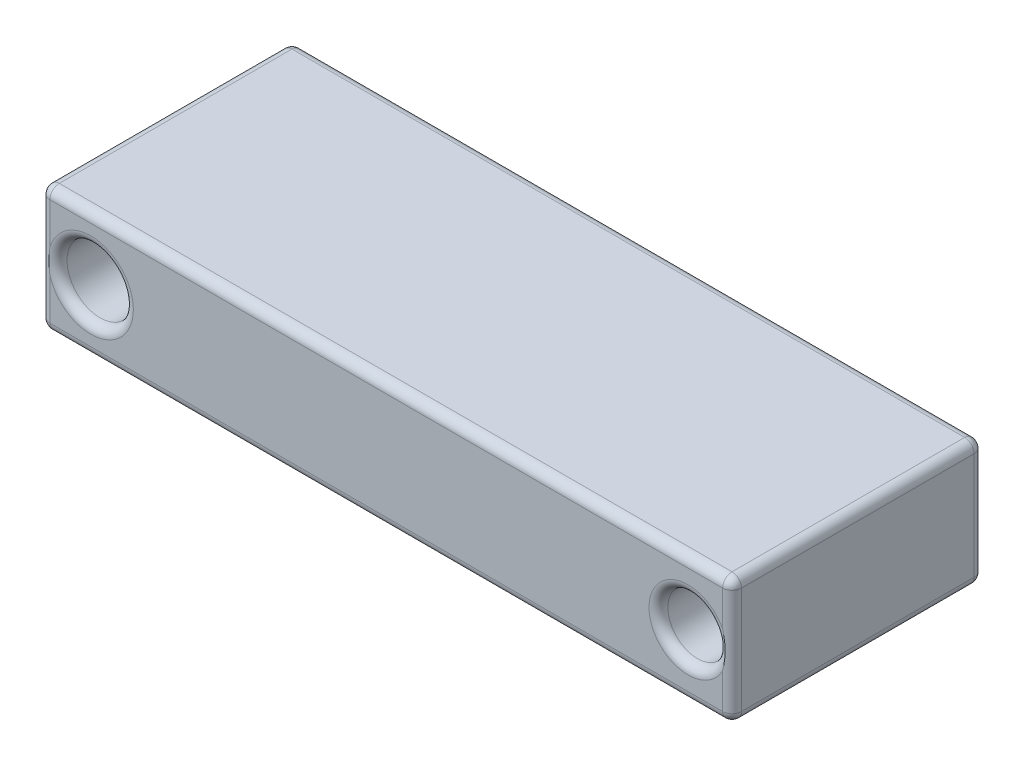
ISO-10303-21;
HEADER;
FILE_DESCRIPTION(('STEP AP214'),'2;1');
FILE_NAME('part.step','',(''),(''),'','','');
FILE_SCHEMA(('AUTOMOTIVE_DESIGN { 1 0 10303 214 1 1 1 1 }'));
ENDSEC;
DATA;
#1=APPLICATION_CONTEXT('core data for automotive mechanical design processes');
#2=APPLICATION_PROTOCOL_DEFINITION('international standard','automotive_design',2000,#1);
#3=PRODUCT_CONTEXT('',#1,'mechanical');
#4=PRODUCT('Part','Part','',(#3));
#5=PRODUCT_RELATED_PRODUCT_CATEGORY('part','',(#4));
#6=PRODUCT_DEFINITION_FORMATION('','',#4);
#7=PRODUCT_DEFINITION_CONTEXT('part definition',#1,'design');
#8=PRODUCT_DEFINITION('design','',#6,#7);
#9=PRODUCT_DEFINITION_SHAPE('','',#8);
#10=(LENGTH_UNIT() NAMED_UNIT(*) SI_UNIT(.MILLI.,.METRE.));
#11=(NAMED_UNIT(*) PLANE_ANGLE_UNIT() SI_UNIT($,.RADIAN.));
#12=(NAMED_UNIT(*) SI_UNIT($,.STERADIAN.) SOLID_ANGLE_UNIT());
#13=UNCERTAINTY_MEASURE_WITH_UNIT(LENGTH_MEASURE(1.E-05),#10,'distance_accuracy_value','');
#14=(GEOMETRIC_REPRESENTATION_CONTEXT(3) GLOBAL_UNCERTAINTY_ASSIGNED_CONTEXT((#13)) GLOBAL_UNIT_ASSIGNED_CONTEXT((#10,
#11,#12)) REPRESENTATION_CONTEXT('',''));
#15=CARTESIAN_POINT('',(0.,0.,0.));
#16=DIRECTION('',(0.,0.,1.));
#17=DIRECTION('',(1.,0.,0.));
#18=AXIS2_PLACEMENT_3D('',#15,#16,#17);
#19=CARTESIAN_POINT('',(-95.3818963448304,55.5062245954553,40.));
#20=DIRECTION('',(1.,0.,0.));
#21=DIRECTION('',(0.,1.,0.));
#22=AXIS2_PLACEMENT_3D('',#19,#20,#21);
#23=PLANE('',#22);
#24=DIRECTION('',(0.,-1.,0.));
#25=VECTOR('',#24,1.);
#26=CARTESIAN_POINT('',(-95.3818963448304,55.5062245954553,1.5));
#27=LINE('',#26,#25);
#28=CARTESIAN_POINT('',(-95.3818963448304,54.0062245954553,1.5));
#29=VERTEX_POINT('',#28);
#30=CARTESIAN_POINT('',(-95.3818963448304,37.0062245954553,1.5));
#31=VERTEX_POINT('',#30);
#32=EDGE_CURVE('E196',#29,#31,#27,.T.);
#33=ORIENTED_EDGE('',*,*,#32,.T.);
#34=DIRECTION('',(0.,0.,-1.));
#35=VECTOR('',#34,1.);
#36=CARTESIAN_POINT('',(-95.3818963448304,37.0062245954553,40.));
#37=LINE('',#36,#35);
#38=CARTESIAN_POINT('',(-95.3818963448304,37.0062245954553,38.5));
#39=VERTEX_POINT('',#38);
#40=EDGE_CURVE('E198',#31,#39,#37,.F.);
#41=ORIENTED_EDGE('',*,*,#40,.T.);
#42=DIRECTION('',(0.,-1.,0.));
#43=VECTOR('',#42,1.);
#44=CARTESIAN_POINT('',(-95.3818963448304,55.5062245954553,38.5));
#45=LINE('',#44,#43);
#46=CARTESIAN_POINT('',(-95.3818963448304,54.0062245954553,38.5));
#47=VERTEX_POINT('',#46);
#48=EDGE_CURVE('E192',#39,#47,#45,.F.);
#49=ORIENTED_EDGE('',*,*,#48,.T.);
#50=DIRECTION('',(0.,0.,-1.));
#51=VECTOR('',#50,1.);
#52=CARTESIAN_POINT('',(-95.3818963448304,54.0062245954553,40.));
#53=LINE('',#52,#51);
#54=EDGE_CURVE('E194',#47,#29,#53,.T.);
#55=ORIENTED_EDGE('',*,*,#54,.T.);
#56=EDGE_LOOP('',(#33,#41,#49,#55));
#57=FACE_BOUND('',#56,.T.);
#58=ADVANCED_FACE('F31',(#57),#23,.F.);
#59=CARTESIAN_POINT('',(-95.3818963448304,35.5062245954553,40.));
#60=DIRECTION('',(0.,1.,0.));
#61=DIRECTION('',(0.,0.,1.));
#62=AXIS2_PLACEMENT_3D('',#59,#60,#61);
#63=PLANE('',#62);
#64=DIRECTION('',(1.,0.,0.));
#65=VECTOR('',#64,1.);
#66=CARTESIAN_POINT('',(-95.3818963448304,35.5062245954553,38.5));
#67=LINE('',#66,#65);
#68=CARTESIAN_POINT('',(13.1181036551696,35.5062245954553,38.5));
#69=VERTEX_POINT('',#68);
#70=CARTESIAN_POINT('',(-93.8818963448304,35.5062245954553,38.5));
#71=VERTEX_POINT('',#70);
#72=EDGE_CURVE('E152',#69,#71,#67,.F.);
#73=ORIENTED_EDGE('',*,*,#72,.T.);
#74=DIRECTION('',(0.,0.,-1.));
#75=VECTOR('',#74,1.);
#76=CARTESIAN_POINT('',(-93.8818963448304,35.5062245954553,40.));
#77=LINE('',#76,#75);
#78=CARTESIAN_POINT('',(-93.8818963448304,35.5062245954553,1.5));
#79=VERTEX_POINT('',#78);
#80=EDGE_CURVE('E190',#71,#79,#77,.T.);
#81=ORIENTED_EDGE('',*,*,#80,.T.);
#82=DIRECTION('',(1.,0.,0.));
#83=VECTOR('',#82,1.);
#84=CARTESIAN_POINT('',(-95.3818963448304,35.5062245954553,1.5));
#85=LINE('',#84,#83);
#86=CARTESIAN_POINT('',(13.1181036551696,35.5062245954553,1.5));
#87=VERTEX_POINT('',#86);
#88=EDGE_CURVE('E155',#79,#87,#85,.T.);
#89=ORIENTED_EDGE('',*,*,#88,.T.);
#90=DIRECTION('',(0.,0.,-1.));
#91=VECTOR('',#90,1.);
#92=CARTESIAN_POINT('',(13.1181036551696,35.5062245954553,40.));
#93=LINE('',#92,#91);
#94=EDGE_CURVE('E147',#87,#69,#93,.F.);
#95=ORIENTED_EDGE('',*,*,#94,.T.);
#96=EDGE_LOOP('',(#73,#81,#89,#95));
#97=FACE_BOUND('',#96,.T.);
#98=ADVANCED_FACE('F149',(#97),#63,.F.);
#99=CARTESIAN_POINT('',(14.6181036551696,55.5062245954553,40.));
#100=DIRECTION('',(-1.,0.,0.));
#101=DIRECTION('',(0.,0.,1.));
#102=AXIS2_PLACEMENT_3D('',#99,#100,#101);
#103=PLANE('',#102);
#104=DIRECTION('',(0.,1.,0.));
#105=VECTOR('',#104,1.);
#106=CARTESIAN_POINT('',(14.6181036551696,35.5062245954553,38.5));
#107=LINE('',#106,#105);
#108=CARTESIAN_POINT('',(14.6181036551696,54.0062245954553,38.5));
#109=VERTEX_POINT('',#108);
#110=CARTESIAN_POINT('',(14.6181036551696,37.0062245954553,38.5));
#111=VERTEX_POINT('',#110);
#112=EDGE_CURVE('E232',#109,#111,#107,.F.);
#113=ORIENTED_EDGE('',*,*,#112,.T.);
#114=DIRECTION('',(0.,0.,-1.));
#115=VECTOR('',#114,1.);
#116=CARTESIAN_POINT('',(14.6181036551696,37.0062245954553,40.));
#117=LINE('',#116,#115);
#118=CARTESIAN_POINT('',(14.6181036551696,37.0062245954553,1.5));
#119=VERTEX_POINT('',#118);
#120=EDGE_CURVE('E166',#111,#119,#117,.T.);
#121=ORIENTED_EDGE('',*,*,#120,.T.);
#122=DIRECTION('',(0.,1.,0.));
#123=VECTOR('',#122,1.);
#124=CARTESIAN_POINT('',(14.6181036551696,55.5062245954553,1.5));
#125=LINE('',#124,#123);
#126=CARTESIAN_POINT('',(14.6181036551696,54.0062245954553,1.5));
#127=VERTEX_POINT('',#126);
#128=EDGE_CURVE('E236',#119,#127,#125,.T.);
#129=ORIENTED_EDGE('',*,*,#128,.T.);
#130=DIRECTION('',(0.,0.,-1.));
#131=VECTOR('',#130,1.);
#132=CARTESIAN_POINT('',(14.6181036551696,54.0062245954553,40.));
#133=LINE('',#132,#131);
#134=EDGE_CURVE('E234',#127,#109,#133,.F.);
#135=ORIENTED_EDGE('',*,*,#134,.T.);
#136=EDGE_LOOP('',(#113,#121,#129,#135));
#137=FACE_BOUND('',#136,.T.);
#138=ADVANCED_FACE('F428',(#137),#103,.F.);
#139=CARTESIAN_POINT('',(-95.3818963448304,55.5062245954553,40.));
#140=DIRECTION('',(0.,-1.,0.));
#141=DIRECTION('',(0.,0.,-1.));
#142=AXIS2_PLACEMENT_3D('',#139,#140,#141);
#143=PLANE('',#142);
#144=DIRECTION('',(0.,0.,-1.));
#145=VECTOR('',#144,1.);
#146=CARTESIAN_POINT('',(13.1181036551696,55.5062245954553,40.));
#147=LINE('',#146,#145);
#148=CARTESIAN_POINT('',(13.1181036551696,55.5062245954553,38.5));
#149=VERTEX_POINT('',#148);
#150=CARTESIAN_POINT('',(13.1181036551696,55.5062245954553,1.5));
#151=VERTEX_POINT('',#150);
#152=EDGE_CURVE('E243',#149,#151,#147,.T.);
#153=ORIENTED_EDGE('',*,*,#152,.T.);
#154=DIRECTION('',(-1.,0.,0.));
#155=VECTOR('',#154,1.);
#156=CARTESIAN_POINT('',(-95.3818963448304,55.5062245954553,1.5));
#157=LINE('',#156,#155);
#158=CARTESIAN_POINT('',(-93.8818963448304,55.5062245954553,1.5));
#159=VERTEX_POINT('',#158);
#160=EDGE_CURVE('E246',#151,#159,#157,.T.);
#161=ORIENTED_EDGE('',*,*,#160,.T.);
#162=DIRECTION('',(0.,0.,-1.));
#163=VECTOR('',#162,1.);
#164=CARTESIAN_POINT('',(-93.8818963448304,55.5062245954553,40.));
#165=LINE('',#164,#163);
#166=CARTESIAN_POINT('',(-93.8818963448304,55.5062245954553,38.5));
#167=VERTEX_POINT('',#166);
#168=EDGE_CURVE('E241',#159,#167,#165,.F.);
#169=ORIENTED_EDGE('',*,*,#168,.T.);
#170=DIRECTION('',(-1.,0.,0.));
#171=VECTOR('',#170,1.);
#172=CARTESIAN_POINT('',(14.6181036551696,55.5062245954553,38.5));
#173=LINE('',#172,#171);
#174=EDGE_CURVE('E239',#167,#149,#173,.F.);
#175=ORIENTED_EDGE('',*,*,#174,.T.);
#176=EDGE_LOOP('',(#153,#161,#169,#175));
#177=FACE_BOUND('',#176,.T.);
#178=ADVANCED_FACE('F656',(#177),#143,.F.);
#179=CARTESIAN_POINT('',(-95.3818963448304,35.5062245954553,40.));
#180=DIRECTION('',(0.,0.,1.));
#181=DIRECTION('',(1.,0.,0.));
#182=AXIS2_PLACEMENT_3D('',#179,#180,#181);
#183=PLANE('',#182);
#184=CARTESIAN_POINT('',(-87.3818963448304,45.5062245954553,40.));
#185=DIRECTION('',(0.,0.,1.));
#186=DIRECTION('',(1.,0.,0.));
#187=AXIS2_PLACEMENT_3D('',#184,#185,#186);
#188=CIRCLE('',#187,6.77503221367372);
#189=CARTESIAN_POINT('',(-93.8818963448304,47.4169996989975,40.));
#190=VERTEX_POINT('',#189);
#191=CARTESIAN_POINT('',(-80.6068641311566,45.5062245954553,40.));
#192=VERTEX_POINT('',#191);
#193=EDGE_CURVE('E51',#190,#192,#188,.F.);
#194=ORIENTED_EDGE('',*,*,#193,.T.);
#195=CARTESIAN_POINT('',(-87.3818963448304,45.5062245954553,40.));
#196=DIRECTION('',(0.,0.,1.));
#197=DIRECTION('',(1.,0.,0.));
#198=AXIS2_PLACEMENT_3D('',#195,#196,#197);
#199=CIRCLE('',#198,6.77503221367372);
#200=CARTESIAN_POINT('',(-93.8818963448304,43.5954494919131,40.));
#201=VERTEX_POINT('',#200);
#202=EDGE_CURVE('E11',#192,#201,#199,.F.);
#203=ORIENTED_EDGE('',*,*,#202,.T.);
#204=DIRECTION('',(0.,-1.,0.));
#205=VECTOR('',#204,1.);
#206=CARTESIAN_POINT('',(-93.8818963448304,35.5062245954553,40.));
#207=LINE('',#206,#205);
#208=CARTESIAN_POINT('',(-93.8818963448304,37.0062245954553,40.));
#209=VERTEX_POINT('',#208);
#210=EDGE_CURVE('E40',#201,#209,#207,.T.);
#211=ORIENTED_EDGE('',*,*,#210,.T.);
#212=DIRECTION('',(1.,0.,0.));
#213=VECTOR('',#212,1.);
#214=CARTESIAN_POINT('',(14.6181036551696,37.0062245954553,40.));
#215=LINE('',#214,#213);
#216=CARTESIAN_POINT('',(13.1181036551696,37.0062245954553,40.));
#217=VERTEX_POINT('',#216);
#218=EDGE_CURVE('E259',#209,#217,#215,.T.);
#219=ORIENTED_EDGE('',*,*,#218,.T.);
#220=DIRECTION('',(0.,1.,0.));
#221=VECTOR('',#220,1.);
#222=CARTESIAN_POINT('',(13.1181036551696,55.5062245954553,40.));
#223=LINE('',#222,#221);
#224=CARTESIAN_POINT('',(13.1181036551696,42.614107788662,40.));
#225=VERTEX_POINT('',#224);
#226=EDGE_CURVE('E252',#217,#225,#223,.T.);
#227=ORIENTED_EDGE('',*,*,#226,.T.);
#228=CARTESIAN_POINT('',(7.61810365516963,45.5062245954553,40.));
#229=DIRECTION('',(0.,0.,1.));
#230=DIRECTION('',(1.,0.,0.));
#231=AXIS2_PLACEMENT_3D('',#228,#229,#230);
#232=CIRCLE('',#231,6.21404374173019);
#233=CARTESIAN_POINT('',(13.1181036551696,48.3983414022486,40.));
#234=VERTEX_POINT('',#233);
#235=EDGE_CURVE('E248',#225,#234,#232,.F.);
#236=ORIENTED_EDGE('',*,*,#235,.T.);
#237=DIRECTION('',(0.,1.,0.));
#238=VECTOR('',#237,1.);
#239=CARTESIAN_POINT('',(13.1181036551696,55.5062245954553,40.));
#240=LINE('',#239,#238);
#241=CARTESIAN_POINT('',(13.1181036551696,54.0062245954553,40.));
#242=VERTEX_POINT('',#241);
#243=EDGE_CURVE('E250',#234,#242,#240,.T.);
#244=ORIENTED_EDGE('',*,*,#243,.T.);
#245=DIRECTION('',(-1.,0.,0.));
#246=VECTOR('',#245,1.);
#247=CARTESIAN_POINT('',(-95.3818963448304,54.0062245954553,40.));
#248=LINE('',#247,#246);
#249=CARTESIAN_POINT('',(-93.8818963448304,54.0062245954553,40.));
#250=VERTEX_POINT('',#249);
#251=EDGE_CURVE('E254',#242,#250,#248,.T.);
#252=ORIENTED_EDGE('',*,*,#251,.T.);
#253=DIRECTION('',(0.,-1.,0.));
#254=VECTOR('',#253,1.);
#255=CARTESIAN_POINT('',(-93.8818963448304,35.5062245954553,40.));
#256=LINE('',#255,#254);
#257=EDGE_CURVE('E257',#250,#190,#256,.T.);
#258=ORIENTED_EDGE('',*,*,#257,.T.);
#259=EDGE_LOOP('',(#194,#203,#211,#219,#227,#236,#244,#252,#258));
#260=FACE_BOUND('',#259,.T.);
#261=ADVANCED_FACE('F406',(#260),#183,.T.);
#262=CARTESIAN_POINT('',(-95.3818963448304,35.5062245954553,0.));
#263=DIRECTION('',(0.,0.,1.));
#264=DIRECTION('',(1.,0.,0.));
#265=AXIS2_PLACEMENT_3D('',#262,#263,#264);
#266=PLANE('',#265);
#267=DIRECTION('',(0.,1.,0.));
#268=VECTOR('',#267,1.);
#269=CARTESIAN_POINT('',(13.1181036551696,35.5062245954553,0.));
#270=LINE('',#269,#268);
#271=CARTESIAN_POINT('',(13.1181036551696,42.614107788662,0.));
#272=VERTEX_POINT('',#271);
#273=CARTESIAN_POINT('',(13.1181036551696,37.0062245954553,0.));
#274=VERTEX_POINT('',#273);
#275=EDGE_CURVE('E209',#272,#274,#270,.F.);
#276=ORIENTED_EDGE('',*,*,#275,.T.);
#277=DIRECTION('',(1.,0.,0.));
#278=VECTOR('',#277,1.);
#279=CARTESIAN_POINT('',(-95.3818963448304,37.0062245954553,0.));
#280=LINE('',#279,#278);
#281=CARTESIAN_POINT('',(-93.8818963448304,37.0062245954553,0.));
#282=VERTEX_POINT('',#281);
#283=EDGE_CURVE('E217',#274,#282,#280,.F.);
#284=ORIENTED_EDGE('',*,*,#283,.T.);
#285=DIRECTION('',(0.,-1.,0.));
#286=VECTOR('',#285,1.);
#287=CARTESIAN_POINT('',(-93.8818963448304,35.5062245954553,0.));
#288=LINE('',#287,#286);
#289=CARTESIAN_POINT('',(-93.8818963448304,43.5954494919131,0.));
#290=VERTEX_POINT('',#289);
#291=EDGE_CURVE('E215',#282,#290,#288,.F.);
#292=ORIENTED_EDGE('',*,*,#291,.T.);
#293=CARTESIAN_POINT('',(-87.3818963448304,45.5062245954553,0.));
#294=DIRECTION('',(0.,0.,1.));
#295=DIRECTION('',(1.,0.,0.));
#296=AXIS2_PLACEMENT_3D('',#293,#294,#295);
#297=CIRCLE('',#296,6.77503221367372);
#298=CARTESIAN_POINT('',(-80.6068641311566,45.5062245954553,0.));
#299=VERTEX_POINT('',#298);
#300=EDGE_CURVE('E213',#290,#299,#297,.T.);
#301=ORIENTED_EDGE('',*,*,#300,.T.);
#302=CARTESIAN_POINT('',(-87.3818963448304,45.5062245954553,0.));
#303=DIRECTION('',(0.,0.,1.));
#304=DIRECTION('',(1.,0.,0.));
#305=AXIS2_PLACEMENT_3D('',#302,#303,#304);
#306=CIRCLE('',#305,6.77503221367372);
#307=CARTESIAN_POINT('',(-93.8818963448304,47.4169996989975,0.));
#308=VERTEX_POINT('',#307);
#309=EDGE_CURVE('E211',#299,#308,#306,.T.);
#310=ORIENTED_EDGE('',*,*,#309,.T.);
#311=DIRECTION('',(0.,-1.,0.));
#312=VECTOR('',#311,1.);
#313=CARTESIAN_POINT('',(-93.8818963448304,35.5062245954553,0.));
#314=LINE('',#313,#312);
#315=CARTESIAN_POINT('',(-93.8818963448304,54.0062245954553,0.));
#316=VERTEX_POINT('',#315);
#317=EDGE_CURVE('E207',#308,#316,#314,.F.);
#318=ORIENTED_EDGE('',*,*,#317,.T.);
#319=DIRECTION('',(-1.,0.,0.));
#320=VECTOR('',#319,1.);
#321=CARTESIAN_POINT('',(-95.3818963448304,54.0062245954553,0.));
#322=LINE('',#321,#320);
#323=CARTESIAN_POINT('',(13.1181036551696,54.0062245954553,0.));
#324=VERTEX_POINT('',#323);
#325=EDGE_CURVE('E201',#316,#324,#322,.F.);
#326=ORIENTED_EDGE('',*,*,#325,.T.);
#327=DIRECTION('',(0.,1.,0.));
#328=VECTOR('',#327,1.);
#329=CARTESIAN_POINT('',(13.1181036551696,35.5062245954553,0.));
#330=LINE('',#329,#328);
#331=CARTESIAN_POINT('',(13.1181036551696,48.3983414022486,0.));
#332=VERTEX_POINT('',#331);
#333=EDGE_CURVE('E203',#324,#332,#330,.F.);
#334=ORIENTED_EDGE('',*,*,#333,.T.);
#335=CARTESIAN_POINT('',(7.61810365516963,45.5062245954553,0.));
#336=DIRECTION('',(0.,0.,1.));
#337=DIRECTION('',(1.,0.,0.));
#338=AXIS2_PLACEMENT_3D('',#335,#336,#337);
#339=CIRCLE('',#338,6.21404374173019);
#340=EDGE_CURVE('E205',#332,#272,#339,.T.);
#341=ORIENTED_EDGE('',*,*,#340,.T.);
#342=EDGE_LOOP('',(#276,#284,#292,#301,#310,#318,#326,#334,#341));
#343=FACE_BOUND('',#342,.T.);
#344=ADVANCED_FACE('F458',(#343),#266,.F.);
#345=CARTESIAN_POINT('',(-87.3818963448304,45.5062245954553,-70.));
#346=DIRECTION('',(0.,0.,1.));
#347=DIRECTION('',(1.,0.,0.));
#348=AXIS2_PLACEMENT_3D('',#345,#346,#347);
#349=CYLINDRICAL_SURFACE('',#348,5.27503221367373);
#350=CARTESIAN_POINT('',(-87.3818963448304,45.5062245954553,1.5));
#351=DIRECTION('',(0.,0.,1.));
#352=DIRECTION('',(1.,0.,0.));
#353=AXIS2_PLACEMENT_3D('',#350,#351,#352);
#354=CIRCLE('',#353,5.27503221367373);
#355=CARTESIAN_POINT('',(-82.1068641311566,45.5062245954553,1.5));
#356=VERTEX_POINT('',#355);
#357=EDGE_CURVE('E223',#356,#356,#354,.F.);
#358=ORIENTED_EDGE('',*,*,#357,.T.);
#359=EDGE_LOOP('',(#358));
#360=FACE_BOUND('',#359,.T.);
#361=CARTESIAN_POINT('',(-87.3818963448304,45.5062245954553,38.5));
#362=DIRECTION('',(0.,0.,1.));
#363=DIRECTION('',(1.,0.,0.));
#364=AXIS2_PLACEMENT_3D('',#361,#362,#363);
#365=CIRCLE('',#364,5.27503221367373);
#366=CARTESIAN_POINT('',(-82.1068641311566,45.5062245954553,38.5));
#367=VERTEX_POINT('',#366);
#368=EDGE_CURVE('E220',#367,#367,#365,.T.);
#369=ORIENTED_EDGE('',*,*,#368,.T.);
#370=EDGE_LOOP('',(#369));
#371=FACE_BOUND('',#370,.T.);
#372=ADVANCED_FACE('F418',(#360,#371),#349,.F.);
#373=CARTESIAN_POINT('',(7.61810365516963,45.5062245954553,-70.));
#374=DIRECTION('',(0.,0.,1.));
#375=DIRECTION('',(1.,0.,0.));
#376=AXIS2_PLACEMENT_3D('',#373,#374,#375);
#377=CYLINDRICAL_SURFACE('',#376,4.71404374173019);
#378=CARTESIAN_POINT('',(7.61810365516963,45.5062245954553,1.5));
#379=DIRECTION('',(0.,0.,1.));
#380=DIRECTION('',(1.,0.,0.));
#381=AXIS2_PLACEMENT_3D('',#378,#379,#380);
#382=CIRCLE('',#381,4.71404374173019);
#383=CARTESIAN_POINT('',(12.3321473968998,45.5062245954553,1.5));
#384=VERTEX_POINT('',#383);
#385=EDGE_CURVE('E229',#384,#384,#382,.F.);
#386=ORIENTED_EDGE('',*,*,#385,.T.);
#387=EDGE_LOOP('',(#386));
#388=FACE_BOUND('',#387,.T.);
#389=CARTESIAN_POINT('',(7.61810365516963,45.5062245954553,38.5));
#390=DIRECTION('',(0.,0.,1.));
#391=DIRECTION('',(1.,0.,0.));
#392=AXIS2_PLACEMENT_3D('',#389,#390,#391);
#393=CIRCLE('',#392,4.71404374173019);
#394=CARTESIAN_POINT('',(12.3321473968998,45.5062245954553,38.5));
#395=VERTEX_POINT('',#394);
#396=EDGE_CURVE('E226',#395,#395,#393,.T.);
#397=ORIENTED_EDGE('',*,*,#396,.T.);
#398=EDGE_LOOP('',(#397));
#399=FACE_BOUND('',#398,.T.);
#400=ADVANCED_FACE('F412',(#388,#399),#377,.F.);
#401=CARTESIAN_POINT('',(7.61810365516963,45.5062245954553,38.5));
#402=DIRECTION('',(0.,0.,1.));
#403=DIRECTION('',(1.,0.,0.));
#404=AXIS2_PLACEMENT_3D('',#401,#402,#403);
#405=TOROIDAL_SURFACE('',#404,6.21404374173019,1.5);
#406=ORIENTED_EDGE('',*,*,#396,.F.);
#407=EDGE_LOOP('',(#406));
#408=FACE_BOUND('',#407,.T.);
#409=CARTESIAN_POINT('',(13.1181036551696,48.3983414022486,40.0000000000002));
#410=CARTESIAN_POINT('',(13.1190108351164,48.3946670290878,39.9999999900651));
#411=CARTESIAN_POINT('',(13.1199163865421,48.3909922392755,39.9999991673936));
#412=CARTESIAN_POINT('',(13.1810919127136,48.1422620348768,39.9998890240707));
#413=CARTESIAN_POINT('',(13.2341170998976,47.8953620247745,39.9962024487694));
#414=CARTESIAN_POINT('',(13.3248821733547,47.3987412846634,39.9863812224742));
#415=CARTESIAN_POINT('',(13.362614814652,47.1490192751587,39.9802454138608));
#416=CARTESIAN_POINT('',(13.4222348443938,46.6473258664844,39.9691598803656));
#417=CARTESIAN_POINT('',(13.4441024756542,46.3953520568254,39.96421163951));
#418=CARTESIAN_POINT('',(13.4715401331192,45.8905252956117,39.9578369007387));
#419=CARTESIAN_POINT('',(13.4771141827083,45.637672576529,39.9564095334251));
#420=CARTESIAN_POINT('',(13.4720898805958,45.152372158647,39.9576318666698));
#421=CARTESIAN_POINT('',(13.4627490437685,44.9199095243563,39.9599646889044));
#422=CARTESIAN_POINT('',(13.4303392422213,44.4559490866011,39.9672366011665));
#423=CARTESIAN_POINT('',(13.4072679666656,44.224451452152,39.9721761298875));
#424=CARTESIAN_POINT('',(13.3477572684213,43.7635085113989,39.9826213207633));
#425=CARTESIAN_POINT('',(13.3113347166938,43.5340609877302,39.9881262621588));
#426=CARTESIAN_POINT('',(13.2255892185915,43.0776010204577,39.9967639394238));
#427=CARTESIAN_POINT('',(13.1762714080837,42.8505876447794,39.999897617779));
#428=CARTESIAN_POINT('',(13.1199163864516,42.6214569526408,39.9999991687853));
#429=CARTESIAN_POINT('',(13.1190108350176,42.6177821628249,39.999999991479));
#430=CARTESIAN_POINT('',(13.1181036551696,42.614107788662,40.));
#431=B_SPLINE_CURVE_WITH_KNOTS('',3,(#409,#410,#411,#412,#413,#414,#415,#416,#417,#418,#419,
#420,#421,#422,#423,#424,#425,#426,#427,#428,#429,#430),.UNSPECIFIED.,.F.,.F.,(4,2,2,2,2,2,2,2,
2,2,4),(0.,0.0113541575576603,0.768425729732102,1.52585555302292,2.28422701536521,
3.04241119673439,3.73997057803038,4.43764739193656,5.13444562839488,5.83096676871599,
5.84232092627595),.UNSPECIFIED.);
#432=EDGE_CURVE('E370',#234,#225,#431,.T.);
#433=ORIENTED_EDGE('',*,*,#432,.F.);
#434=ORIENTED_EDGE('',*,*,#235,.F.);
#435=EDGE_LOOP('',(#433,#434));
#436=FACE_BOUND('',#435,.T.);
#437=ADVANCED_FACE('F366',(#408,#436),#405,.T.);
#438=CARTESIAN_POINT('',(13.1181036551696,54.0062245954553,40.));
#439=DIRECTION('',(0.,0.,-1.));
#440=DIRECTION('',(-1.,0.,0.));
#441=AXIS2_PLACEMENT_3D('',#438,#439,#440);
#442=CYLINDRICAL_SURFACE('',#441,1.5);
#443=CARTESIAN_POINT('',(13.1181036551696,54.0062245954553,38.5));
#444=DIRECTION('',(0.,0.,1.));
#445=DIRECTION('',(1.,0.,0.));
#446=AXIS2_PLACEMENT_3D('',#443,#444,#445);
#447=CIRCLE('',#446,1.5);
#448=EDGE_CURVE('E35',#109,#149,#447,.T.);
#449=ORIENTED_EDGE('',*,*,#448,.F.);
#450=ORIENTED_EDGE('',*,*,#134,.F.);
#451=CARTESIAN_POINT('',(13.1181036551696,54.0062245954553,1.5));
#452=DIRECTION('',(0.,0.,-1.));
#453=DIRECTION('',(-1.,0.,0.));
#454=AXIS2_PLACEMENT_3D('',#451,#452,#453);
#455=CIRCLE('',#454,1.5);
#456=EDGE_CURVE('E187',#151,#127,#455,.T.);
#457=ORIENTED_EDGE('',*,*,#456,.F.);
#458=ORIENTED_EDGE('',*,*,#152,.F.);
#459=EDGE_LOOP('',(#449,#450,#457,#458));
#460=FACE_BOUND('',#459,.T.);
#461=ADVANCED_FACE('F33',(#460),#442,.T.);
#462=CARTESIAN_POINT('',(7.61810365516963,45.5062245954553,1.5));
#463=DIRECTION('',(0.,0.,1.));
#464=DIRECTION('',(1.,0.,0.));
#465=AXIS2_PLACEMENT_3D('',#462,#463,#464);
#466=TOROIDAL_SURFACE('',#465,6.21404374173019,1.5);
#467=ORIENTED_EDGE('',*,*,#385,.F.);
#468=EDGE_LOOP('',(#467));
#469=FACE_BOUND('',#468,.T.);
#470=CARTESIAN_POINT('',(13.1181036551696,48.3983414022486,-1.57139518962499E-13));
#471=CARTESIAN_POINT('',(13.119010835117,48.394667029088,9.93491198037219E-09));
#472=CARTESIAN_POINT('',(13.1199163865434,48.3909922392758,8.32606434442477E-07));
#473=CARTESIAN_POINT('',(13.1810919127535,48.1422620348958,0.000110975929102046));
#474=CARTESIAN_POINT('',(13.2341170999051,47.8953620247948,0.00379755123033658));
#475=CARTESIAN_POINT('',(13.3248821733379,47.3987412846942,0.0136187775251207));
#476=CARTESIAN_POINT('',(13.3626148146431,47.1490192751988,0.0197545861382695));
#477=CARTESIAN_POINT('',(13.4222348443919,46.647325866535,0.0308401196333145));
#478=CARTESIAN_POINT('',(13.444102475651,46.3953520568773,0.0357883604890741));
#479=CARTESIAN_POINT('',(13.4715401331165,45.8905252956689,0.0421630992607728));
#480=CARTESIAN_POINT('',(13.4771141827076,45.63767257659,0.0435904665746854));
#481=CARTESIAN_POINT('',(13.4720898805977,45.152372158705,0.0423681333306164));
#482=CARTESIAN_POINT('',(13.4627490437705,44.9199095244076,0.0400353110962249));
#483=CARTESIAN_POINT('',(13.4303392422254,44.4559490866364,0.0327633988341784));
#484=CARTESIAN_POINT('',(13.4072679666717,44.224451452178,0.0278238701130833));
#485=CARTESIAN_POINT('',(13.3477572684206,43.763508511414,0.0173786792370161));
#486=CARTESIAN_POINT('',(13.3113347166846,43.5340609877434,0.0118737378413987));
#487=CARTESIAN_POINT('',(13.2255892186035,43.0776010204594,0.00323606057626381));
#488=CARTESIAN_POINT('',(13.1762714081255,42.8505876447715,0.000102382221017771));
#489=CARTESIAN_POINT('',(13.1199163864529,42.6214569526405,8.31214670663331E-07));
#490=CARTESIAN_POINT('',(13.1190108350183,42.6177821628248,8.52102616538436E-09));
#491=CARTESIAN_POINT('',(13.1181036551696,42.614107788662,0.));
#492=B_SPLINE_CURVE_WITH_KNOTS('',3,(#470,#471,#472,#473,#474,#475,#476,#477,#478,#479,#480,
#481,#482,#483,#484,#485,#486,#487,#488,#489,#490,#491),.UNSPECIFIED.,.F.,.F.,(4,2,2,2,2,2,2,2,
2,2,4),(0.,0.0113541575576665,0.768425729705278,1.52585555297466,2.28422701531164,
3.04241119666969,3.73997057798627,4.43764739191826,5.13444562838819,5.83096676871607,
5.84232092627607),.UNSPECIFIED.);
#493=EDGE_CURVE('E341',#272,#332,#492,.F.);
#494=ORIENTED_EDGE('',*,*,#493,.F.);
#495=ORIENTED_EDGE('',*,*,#340,.F.);
#496=EDGE_LOOP('',(#494,#495));
#497=FACE_BOUND('',#496,.T.);
#498=ADVANCED_FACE('F351',(#469,#497),#466,.T.);
#499=CARTESIAN_POINT('',(13.1181036551696,54.0062245954553,38.5));
#500=DIRECTION('',(0.,0.,1.));
#501=DIRECTION('',(1.,0.,0.));
#502=AXIS2_PLACEMENT_3D('',#499,#500,#501);
#503=SPHERICAL_SURFACE('',#502,1.5);
#504=CARTESIAN_POINT('',(13.1181036551696,54.0062245954553,38.5));
#505=DIRECTION('',(0.,1.,0.));
#506=DIRECTION('',(0.,0.,1.));
#507=AXIS2_PLACEMENT_3D('',#504,#505,#506);
#508=CIRCLE('',#507,1.5);
#509=EDGE_CURVE('E377',#109,#242,#508,.F.);
#510=ORIENTED_EDGE('',*,*,#509,.F.);
#511=ORIENTED_EDGE('',*,*,#448,.T.);
#512=CARTESIAN_POINT('',(13.1181036551696,54.0062245954553,38.5));
#513=DIRECTION('',(1.,0.,0.));
#514=DIRECTION('',(0.,0.,-1.));
#515=AXIS2_PLACEMENT_3D('',#512,#513,#514);
#516=CIRCLE('',#515,1.5);
#517=EDGE_CURVE('E376',#242,#149,#516,.F.);
#518=ORIENTED_EDGE('',*,*,#517,.F.);
#519=EDGE_LOOP('',(#510,#511,#518));
#520=FACE_BOUND('',#519,.T.);
#521=ADVANCED_FACE('F400',(#520),#503,.T.);
#522=CARTESIAN_POINT('',(13.1181036551696,54.0062245954553,1.5));
#523=DIRECTION('',(0.,0.,1.));
#524=DIRECTION('',(1.,0.,0.));
#525=AXIS2_PLACEMENT_3D('',#522,#523,#524);
#526=SPHERICAL_SURFACE('',#525,1.5);
#527=CARTESIAN_POINT('',(13.1181036551696,54.0062245954553,1.5));
#528=DIRECTION('',(1.,0.,0.));
#529=DIRECTION('',(0.,1.,0.));
#530=AXIS2_PLACEMENT_3D('',#527,#528,#529);
#531=CIRCLE('',#530,1.5);
#532=EDGE_CURVE('E338',#151,#324,#531,.F.);
#533=ORIENTED_EDGE('',*,*,#532,.F.);
#534=ORIENTED_EDGE('',*,*,#456,.T.);
#535=CARTESIAN_POINT('',(13.1181036551696,54.0062245954553,1.5));
#536=DIRECTION('',(0.,1.,0.));
#537=DIRECTION('',(0.,0.,1.));
#538=AXIS2_PLACEMENT_3D('',#535,#536,#537);
#539=CIRCLE('',#538,1.5);
#540=EDGE_CURVE('E349',#324,#127,#539,.F.);
#541=ORIENTED_EDGE('',*,*,#540,.F.);
#542=EDGE_LOOP('',(#533,#534,#541));
#543=FACE_BOUND('',#542,.T.);
#544=ADVANCED_FACE('F385',(#543),#526,.T.);
#545=CARTESIAN_POINT('',(-95.3818963448304,54.0062245954553,38.5));
#546=DIRECTION('',(1.,0.,0.));
#547=DIRECTION('',(0.,0.,-1.));
#548=AXIS2_PLACEMENT_3D('',#545,#546,#547);
#549=CYLINDRICAL_SURFACE('',#548,1.5);
#550=ORIENTED_EDGE('',*,*,#517,.T.);
#551=ORIENTED_EDGE('',*,*,#174,.F.);
#552=CARTESIAN_POINT('',(-93.8818963448304,54.0062245954553,38.5));
#553=DIRECTION('',(-1.,0.,0.));
#554=DIRECTION('',(0.,0.,1.));
#555=AXIS2_PLACEMENT_3D('',#552,#553,#554);
#556=CIRCLE('',#555,1.5);
#557=EDGE_CURVE('E332',#250,#167,#556,.T.);
#558=ORIENTED_EDGE('',*,*,#557,.F.);
#559=ORIENTED_EDGE('',*,*,#251,.F.);
#560=EDGE_LOOP('',(#550,#551,#558,#559));
#561=FACE_BOUND('',#560,.T.);
#562=ADVANCED_FACE('F405',(#561),#549,.T.);
#563=CARTESIAN_POINT('',(13.1181036551696,35.5062245954553,38.5));
#564=DIRECTION('',(0.,-1.,0.));
#565=DIRECTION('',(0.,0.,-1.));
#566=AXIS2_PLACEMENT_3D('',#563,#564,#565);
#567=CYLINDRICAL_SURFACE('',#566,1.5);
#568=ORIENTED_EDGE('',*,*,#432,.T.);
#569=ORIENTED_EDGE('',*,*,#226,.F.);
#570=CARTESIAN_POINT('',(13.1181036551696,37.0062245954553,38.5));
#571=DIRECTION('',(0.,-1.,0.));
#572=DIRECTION('',(0.,0.,-1.));
#573=AXIS2_PLACEMENT_3D('',#570,#571,#572);
#574=CIRCLE('',#573,1.5);
#575=EDGE_CURVE('E170',#111,#217,#574,.T.);
#576=ORIENTED_EDGE('',*,*,#575,.F.);
#577=ORIENTED_EDGE('',*,*,#112,.F.);
#578=ORIENTED_EDGE('',*,*,#509,.T.);
#579=ORIENTED_EDGE('',*,*,#243,.F.);
#580=EDGE_LOOP('',(#568,#569,#576,#577,#578,#579));
#581=FACE_BOUND('',#580,.T.);
#582=ADVANCED_FACE('F363',(#581),#567,.T.);
#583=CARTESIAN_POINT('',(13.1181036551696,37.0062245954553,40.));
#584=DIRECTION('',(0.,0.,-1.));
#585=DIRECTION('',(-1.,0.,0.));
#586=AXIS2_PLACEMENT_3D('',#583,#584,#585);
#587=CYLINDRICAL_SURFACE('',#586,1.5);
#588=CARTESIAN_POINT('',(13.1181036551696,37.0062245954553,1.5));
#589=DIRECTION('',(0.,0.,-1.));
#590=DIRECTION('',(-1.,0.,0.));
#591=AXIS2_PLACEMENT_3D('',#588,#589,#590);
#592=CIRCLE('',#591,1.5);
#593=EDGE_CURVE('E171',#119,#87,#592,.T.);
#594=ORIENTED_EDGE('',*,*,#593,.F.);
#595=ORIENTED_EDGE('',*,*,#120,.F.);
#596=CARTESIAN_POINT('',(13.1181036551696,37.0062245954553,38.5));
#597=DIRECTION('',(0.,0.,1.));
#598=DIRECTION('',(1.,0.,0.));
#599=AXIS2_PLACEMENT_3D('',#596,#597,#598);
#600=CIRCLE('',#599,1.5);
#601=EDGE_CURVE('E162',#69,#111,#600,.T.);
#602=ORIENTED_EDGE('',*,*,#601,.F.);
#603=ORIENTED_EDGE('',*,*,#94,.F.);
#604=EDGE_LOOP('',(#594,#595,#602,#603));
#605=FACE_BOUND('',#604,.T.);
#606=ADVANCED_FACE('F164',(#605),#587,.T.);
#607=CARTESIAN_POINT('',(13.1181036551696,55.5062245954553,1.5));
#608=DIRECTION('',(0.,1.,0.));
#609=DIRECTION('',(0.,0.,1.));
#610=AXIS2_PLACEMENT_3D('',#607,#608,#609);
#611=CYLINDRICAL_SURFACE('',#610,1.5);
#612=ORIENTED_EDGE('',*,*,#540,.T.);
#613=ORIENTED_EDGE('',*,*,#128,.F.);
#614=CARTESIAN_POINT('',(13.1181036551696,37.0062245954553,1.5));
#615=DIRECTION('',(0.,-1.,0.));
#616=DIRECTION('',(0.,0.,-1.));
#617=AXIS2_PLACEMENT_3D('',#614,#615,#616);
#618=CIRCLE('',#617,1.5);
#619=EDGE_CURVE('E328',#274,#119,#618,.T.);
#620=ORIENTED_EDGE('',*,*,#619,.F.);
#621=ORIENTED_EDGE('',*,*,#275,.F.);
#622=ORIENTED_EDGE('',*,*,#493,.T.);
#623=ORIENTED_EDGE('',*,*,#333,.F.);
#624=EDGE_LOOP('',(#612,#613,#620,#621,#622,#623));
#625=FACE_BOUND('',#624,.T.);
#626=ADVANCED_FACE('F356',(#625),#611,.T.);
#627=CARTESIAN_POINT('',(-95.3818963448304,54.0062245954553,1.5));
#628=DIRECTION('',(-1.,0.,0.));
#629=DIRECTION('',(0.,0.,1.));
#630=AXIS2_PLACEMENT_3D('',#627,#628,#629);
#631=CYLINDRICAL_SURFACE('',#630,1.5);
#632=ORIENTED_EDGE('',*,*,#532,.T.);
#633=ORIENTED_EDGE('',*,*,#325,.F.);
#634=CARTESIAN_POINT('',(-93.8818963448304,54.0062245954553,1.5));
#635=DIRECTION('',(-1.,0.,0.));
#636=DIRECTION('',(0.,0.,1.));
#637=AXIS2_PLACEMENT_3D('',#634,#635,#636);
#638=CIRCLE('',#637,1.5);
#639=EDGE_CURVE('E325',#159,#316,#638,.T.);
#640=ORIENTED_EDGE('',*,*,#639,.F.);
#641=ORIENTED_EDGE('',*,*,#160,.F.);
#642=EDGE_LOOP('',(#632,#633,#640,#641));
#643=FACE_BOUND('',#642,.T.);
#644=ADVANCED_FACE('F359',(#643),#631,.T.);
#645=CARTESIAN_POINT('',(-93.8818963448304,54.0062245954553,40.));
#646=DIRECTION('',(0.,0.,-1.));
#647=DIRECTION('',(-1.,0.,0.));
#648=AXIS2_PLACEMENT_3D('',#645,#646,#647);
#649=CYLINDRICAL_SURFACE('',#648,1.5);
#650=CARTESIAN_POINT('',(-93.8818963448304,54.0062245954553,38.5));
#651=DIRECTION('',(0.,0.,1.));
#652=DIRECTION('',(1.,0.,0.));
#653=AXIS2_PLACEMENT_3D('',#650,#651,#652);
#654=CIRCLE('',#653,1.5);
#655=EDGE_CURVE('E335',#167,#47,#654,.T.);
#656=ORIENTED_EDGE('',*,*,#655,.F.);
#657=ORIENTED_EDGE('',*,*,#168,.F.);
#658=CARTESIAN_POINT('',(-93.8818963448304,54.0062245954553,1.5));
#659=DIRECTION('',(0.,0.,-1.));
#660=DIRECTION('',(-1.,0.,0.));
#661=AXIS2_PLACEMENT_3D('',#658,#659,#660);
#662=CIRCLE('',#661,1.5);
#663=EDGE_CURVE('E322',#29,#159,#662,.T.);
#664=ORIENTED_EDGE('',*,*,#663,.F.);
#665=ORIENTED_EDGE('',*,*,#54,.F.);
#666=EDGE_LOOP('',(#656,#657,#664,#665));
#667=FACE_BOUND('',#666,.T.);
#668=ADVANCED_FACE('F493',(#667),#649,.T.);
#669=CARTESIAN_POINT('',(-93.8818963448304,54.0062245954553,38.5));
#670=DIRECTION('',(0.,0.,1.));
#671=DIRECTION('',(1.,0.,0.));
#672=AXIS2_PLACEMENT_3D('',#669,#670,#671);
#673=SPHERICAL_SURFACE('',#672,1.5);
#674=ORIENTED_EDGE('',*,*,#557,.T.);
#675=ORIENTED_EDGE('',*,*,#655,.T.);
#676=CARTESIAN_POINT('',(-93.8818963448304,54.0062245954553,38.5));
#677=DIRECTION('',(0.,1.,0.));
#678=DIRECTION('',(0.,0.,1.));
#679=AXIS2_PLACEMENT_3D('',#676,#677,#678);
#680=CIRCLE('',#679,1.5);
#681=EDGE_CURVE('E319',#250,#47,#680,.F.);
#682=ORIENTED_EDGE('',*,*,#681,.F.);
#683=EDGE_LOOP('',(#674,#675,#682));
#684=FACE_BOUND('',#683,.T.);
#685=ADVANCED_FACE('F500',(#684),#673,.T.);
#686=CARTESIAN_POINT('',(-87.3818963448304,45.5062245954553,38.5));
#687=DIRECTION('',(0.,0.,1.));
#688=DIRECTION('',(1.,0.,0.));
#689=AXIS2_PLACEMENT_3D('',#686,#687,#688);
#690=TOROIDAL_SURFACE('',#689,6.77503221367372,1.5);
#691=ORIENTED_EDGE('',*,*,#368,.F.);
#692=EDGE_LOOP('',(#691));
#693=FACE_BOUND('',#692,.T.);
#694=ORIENTED_EDGE('',*,*,#202,.F.);
#695=ORIENTED_EDGE('',*,*,#193,.F.);
#696=CARTESIAN_POINT('',(-93.8818963448304,43.5954494919131,40.));
#697=CARTESIAN_POINT('',(-93.8825890152434,43.6002617684606,39.9999999830194));
#698=CARTESIAN_POINT('',(-93.8832791216589,43.6050744350726,39.9999995038742));
#699=CARTESIAN_POINT('',(-93.9196049412176,43.8593692304429,39.9999502297938));
#700=CARTESIAN_POINT('',(-93.9483506108585,44.1098904891969,39.9986835069814));
#701=CARTESIAN_POINT('',(-93.9916863028605,44.6122191608059,39.9961350149443));
#702=CARTESIAN_POINT('',(-94.0062712837151,44.8640269996609,39.9948532405251));
#703=CARTESIAN_POINT('',(-94.0210883080003,45.3681597164376,39.993546412822));
#704=CARTESIAN_POINT('',(-94.0213154926664,45.6204847404911,39.9935217849646));
#705=CARTESIAN_POINT('',(-94.0073991400063,46.1246698211005,39.9947580500105));
#706=CARTESIAN_POINT('',(-93.9932599275836,46.3765299947362,39.9960185560337));
#707=CARTESIAN_POINT('',(-93.9610918390257,46.7573114341893,39.9979443564525));
#708=CARTESIAN_POINT('',(-93.9482636720498,46.8866946725485,39.9986022417175));
#709=CARTESIAN_POINT('',(-93.9188890049223,47.1449957437641,39.9996166820551));
#710=CARTESIAN_POINT('',(-93.9023439806463,47.2739137407682,39.9999733564647));
#711=CARTESIAN_POINT('',(-93.8832791209178,47.4073747469543,39.9999995146097));
#712=CARTESIAN_POINT('',(-93.8825890144606,47.4121874136118,39.9999999940158));
#713=CARTESIAN_POINT('',(-93.8818963448304,47.4169996989975,40.));
#714=B_SPLINE_CURVE_WITH_KNOTS('',3,(#696,#697,#698,#699,#700,#701,#702,#703,#704,#705,#706,
#707,#708,#709,#710,#711,#712,#713),.UNSPECIFIED.,.F.,.F.,(4,2,2,2,2,2,2,2,4),(0.,
0.0145856767413905,0.770625482416539,1.52693435575088,2.28349916718425,3.03983628752327,
3.4298517122259,3.81971254395242,3.83429822069381),.UNSPECIFIED.);
#715=EDGE_CURVE('E178',#201,#190,#714,.T.);
#716=ORIENTED_EDGE('',*,*,#715,.F.);
#717=EDGE_LOOP('',(#694,#695,#716));
#718=FACE_BOUND('',#717,.T.);
#719=ADVANCED_FACE('F310',(#693,#718),#690,.T.);
#720=CARTESIAN_POINT('',(13.1181036551696,37.0062245954553,38.5));
#721=DIRECTION('',(0.,0.,1.));
#722=DIRECTION('',(1.,0.,0.));
#723=AXIS2_PLACEMENT_3D('',#720,#721,#722);
#724=SPHERICAL_SURFACE('',#723,1.5);
#725=ORIENTED_EDGE('',*,*,#601,.T.);
#726=ORIENTED_EDGE('',*,*,#575,.T.);
#727=CARTESIAN_POINT('',(13.1181036551696,37.0062245954553,38.5));
#728=DIRECTION('',(1.,0.,0.));
#729=DIRECTION('',(0.,1.,0.));
#730=AXIS2_PLACEMENT_3D('',#727,#728,#729);
#731=CIRCLE('',#730,1.5);
#732=EDGE_CURVE('E174',#69,#217,#731,.F.);
#733=ORIENTED_EDGE('',*,*,#732,.F.);
#734=EDGE_LOOP('',(#725,#726,#733));
#735=FACE_BOUND('',#734,.T.);
#736=ADVANCED_FACE('F175',(#735),#724,.T.);
#737=CARTESIAN_POINT('',(13.1181036551696,37.0062245954553,1.5));
#738=DIRECTION('',(0.,0.,1.));
#739=DIRECTION('',(1.,0.,0.));
#740=AXIS2_PLACEMENT_3D('',#737,#738,#739);
#741=SPHERICAL_SURFACE('',#740,1.5);
#742=ORIENTED_EDGE('',*,*,#619,.T.);
#743=ORIENTED_EDGE('',*,*,#593,.T.);
#744=CARTESIAN_POINT('',(13.1181036551696,37.0062245954553,1.5));
#745=DIRECTION('',(1.,0.,0.));
#746=DIRECTION('',(0.,0.,-1.));
#747=AXIS2_PLACEMENT_3D('',#744,#745,#746);
#748=CIRCLE('',#747,1.5);
#749=EDGE_CURVE('E179',#274,#87,#748,.F.);
#750=ORIENTED_EDGE('',*,*,#749,.F.);
#751=EDGE_LOOP('',(#742,#743,#750));
#752=FACE_BOUND('',#751,.T.);
#753=ADVANCED_FACE('F294',(#752),#741,.T.);
#754=CARTESIAN_POINT('',(-87.3818963448304,45.5062245954553,1.5));
#755=DIRECTION('',(0.,0.,1.));
#756=DIRECTION('',(1.,0.,0.));
#757=AXIS2_PLACEMENT_3D('',#754,#755,#756);
#758=TOROIDAL_SURFACE('',#757,6.77503221367372,1.5);
#759=ORIENTED_EDGE('',*,*,#357,.F.);
#760=EDGE_LOOP('',(#759));
#761=FACE_BOUND('',#760,.T.);
#762=ORIENTED_EDGE('',*,*,#309,.F.);
#763=ORIENTED_EDGE('',*,*,#300,.F.);
#764=CARTESIAN_POINT('',(-93.8818963448304,47.4169996989975,0.));
#765=CARTESIAN_POINT('',(-93.8825890152443,47.4121874224501,1.69806656531197E-08));
#766=CARTESIAN_POINT('',(-93.8832791216607,47.4073747558382,4.96125805868735E-07));
#767=CARTESIAN_POINT('',(-93.9196049412621,47.1530799604823,4.97702059964903E-05));
#768=CARTESIAN_POINT('',(-93.9483506108689,46.9025587017318,0.00131649301849291));
#769=CARTESIAN_POINT('',(-93.9916863028462,46.400230030134,0.00386498505565465));
#770=CARTESIAN_POINT('',(-94.0062712837102,46.1484221912867,0.00514675947475972));
#771=CARTESIAN_POINT('',(-94.0210883080027,45.6442894745197,0.00645358717791956));
#772=CARTESIAN_POINT('',(-94.0213154926665,45.3919644504682,0.00647821503545784));
#773=CARTESIAN_POINT('',(-94.0073991400091,44.8877793698642,0.00524194998968466));
#774=CARTESIAN_POINT('',(-93.9932599275916,44.6359191962318,0.00398144396657496));
#775=CARTESIAN_POINT('',(-93.9610918390285,44.2551377567725,0.00205564354780332));
#776=CARTESIAN_POINT('',(-93.9482636720477,44.1257545184031,0.00139775828270303));
#777=CARTESIAN_POINT('',(-93.9188890049313,43.8674534471652,0.000383317944929457));
#778=CARTESIAN_POINT('',(-93.9023439806714,43.7385354501488,2.66435353896139E-05));
#779=CARTESIAN_POINT('',(-93.8832791209196,43.605074443956,4.85390309714923E-07));
#780=CARTESIAN_POINT('',(-93.8825890144615,43.6002617772986,5.98416168815291E-09));
#781=CARTESIAN_POINT('',(-93.8818963448304,43.5954494919131,0.));
#782=B_SPLINE_CURVE_WITH_KNOTS('',3,(#764,#765,#766,#767,#768,#769,#770,#771,#772,#773,#774,
#775,#776,#777,#778,#779,#780,#781),.UNSPECIFIED.,.F.,.F.,(4,2,2,2,2,2,2,2,4),(0.,
0.014585676741386,0.770625482391998,1.52693435570698,2.28349916713363,3.03983628746154,
3.42985171219631,3.81971254395258,3.83429822069396),.UNSPECIFIED.);
#783=EDGE_CURVE('E279',#308,#290,#782,.T.);
#784=ORIENTED_EDGE('',*,*,#783,.F.);
#785=EDGE_LOOP('',(#762,#763,#784));
#786=FACE_BOUND('',#785,.T.);
#787=ADVANCED_FACE('F289',(#761,#786),#758,.T.);
#788=CARTESIAN_POINT('',(-93.8818963448304,54.0062245954553,1.5));
#789=DIRECTION('',(0.,0.,1.));
#790=DIRECTION('',(1.,0.,0.));
#791=AXIS2_PLACEMENT_3D('',#788,#789,#790);
#792=SPHERICAL_SURFACE('',#791,1.5);
#793=ORIENTED_EDGE('',*,*,#663,.T.);
#794=ORIENTED_EDGE('',*,*,#639,.T.);
#795=CARTESIAN_POINT('',(-93.8818963448304,54.0062245954553,1.5));
#796=DIRECTION('',(0.,1.,0.));
#797=DIRECTION('',(0.,0.,1.));
#798=AXIS2_PLACEMENT_3D('',#795,#796,#797);
#799=CIRCLE('',#798,1.5);
#800=EDGE_CURVE('E276',#29,#316,#799,.F.);
#801=ORIENTED_EDGE('',*,*,#800,.F.);
#802=EDGE_LOOP('',(#793,#794,#801));
#803=FACE_BOUND('',#802,.T.);
#804=ADVANCED_FACE('F293',(#803),#792,.T.);
#805=CARTESIAN_POINT('',(-93.8818963448304,35.5062245954553,38.5));
#806=DIRECTION('',(0.,1.,0.));
#807=DIRECTION('',(-1.,0.,0.));
#808=AXIS2_PLACEMENT_3D('',#805,#806,#807);
#809=CYLINDRICAL_SURFACE('',#808,1.5);
#810=ORIENTED_EDGE('',*,*,#681,.T.);
#811=ORIENTED_EDGE('',*,*,#48,.F.);
#812=CARTESIAN_POINT('',(-93.8818963448304,37.0062245954553,38.5));
#813=DIRECTION('',(0.,-1.,0.));
#814=DIRECTION('',(0.,0.,-1.));
#815=AXIS2_PLACEMENT_3D('',#812,#813,#814);
#816=CIRCLE('',#815,1.5);
#817=EDGE_CURVE('E273',#209,#39,#816,.T.);
#818=ORIENTED_EDGE('',*,*,#817,.F.);
#819=ORIENTED_EDGE('',*,*,#210,.F.);
#820=ORIENTED_EDGE('',*,*,#715,.T.);
#821=ORIENTED_EDGE('',*,*,#257,.F.);
#822=EDGE_LOOP('',(#810,#811,#818,#819,#820,#821));
#823=FACE_BOUND('',#822,.T.);
#824=ADVANCED_FACE('F307',(#823),#809,.T.);
#825=CARTESIAN_POINT('',(-95.3818963448304,37.0062245954553,38.5));
#826=DIRECTION('',(-1.,0.,0.));
#827=DIRECTION('',(0.,0.,1.));
#828=AXIS2_PLACEMENT_3D('',#825,#826,#827);
#829=CYLINDRICAL_SURFACE('',#828,1.5);
#830=ORIENTED_EDGE('',*,*,#732,.T.);
#831=ORIENTED_EDGE('',*,*,#218,.F.);
#832=CARTESIAN_POINT('',(-93.8818963448304,37.0062245954553,38.5));
#833=DIRECTION('',(-1.,0.,0.));
#834=DIRECTION('',(0.,0.,1.));
#835=AXIS2_PLACEMENT_3D('',#832,#833,#834);
#836=CIRCLE('',#835,1.5);
#837=EDGE_CURVE('E183',#71,#209,#836,.T.);
#838=ORIENTED_EDGE('',*,*,#837,.F.);
#839=ORIENTED_EDGE('',*,*,#72,.F.);
#840=EDGE_LOOP('',(#830,#831,#838,#839));
#841=FACE_BOUND('',#840,.T.);
#842=ADVANCED_FACE('F181',(#841),#829,.T.);
#843=CARTESIAN_POINT('',(-95.3818963448304,37.0062245954553,1.5));
#844=DIRECTION('',(1.,0.,0.));
#845=DIRECTION('',(0.,0.,-1.));
#846=AXIS2_PLACEMENT_3D('',#843,#844,#845);
#847=CYLINDRICAL_SURFACE('',#846,1.5);
#848=ORIENTED_EDGE('',*,*,#749,.T.);
#849=ORIENTED_EDGE('',*,*,#88,.F.);
#850=CARTESIAN_POINT('',(-93.8818963448304,37.0062245954553,1.5));
#851=DIRECTION('',(-1.,0.,0.));
#852=DIRECTION('',(0.,0.,1.));
#853=AXIS2_PLACEMENT_3D('',#850,#851,#852);
#854=CIRCLE('',#853,1.5);
#855=EDGE_CURVE('E269',#282,#79,#854,.T.);
#856=ORIENTED_EDGE('',*,*,#855,.F.);
#857=ORIENTED_EDGE('',*,*,#283,.F.);
#858=EDGE_LOOP('',(#848,#849,#856,#857));
#859=FACE_BOUND('',#858,.T.);
#860=ADVANCED_FACE('F300',(#859),#847,.T.);
#861=CARTESIAN_POINT('',(-93.8818963448304,55.5062245954553,1.5));
#862=DIRECTION('',(0.,-1.,0.));
#863=DIRECTION('',(1.,0.,0.));
#864=AXIS2_PLACEMENT_3D('',#861,#862,#863);
#865=CYLINDRICAL_SURFACE('',#864,1.5);
#866=ORIENTED_EDGE('',*,*,#783,.T.);
#867=ORIENTED_EDGE('',*,*,#291,.F.);
#868=CARTESIAN_POINT('',(-93.8818963448304,37.0062245954553,1.5));
#869=DIRECTION('',(0.,-1.,0.));
#870=DIRECTION('',(0.,0.,-1.));
#871=AXIS2_PLACEMENT_3D('',#868,#869,#870);
#872=CIRCLE('',#871,1.5);
#873=EDGE_CURVE('E267',#31,#282,#872,.T.);
#874=ORIENTED_EDGE('',*,*,#873,.F.);
#875=ORIENTED_EDGE('',*,*,#32,.F.);
#876=ORIENTED_EDGE('',*,*,#800,.T.);
#877=ORIENTED_EDGE('',*,*,#317,.F.);
#878=EDGE_LOOP('',(#866,#867,#874,#875,#876,#877));
#879=FACE_BOUND('',#878,.T.);
#880=ADVANCED_FACE('F296',(#879),#865,.T.);
#881=CARTESIAN_POINT('',(-93.8818963448304,37.0062245954553,38.5));
#882=DIRECTION('',(0.,0.,1.));
#883=DIRECTION('',(1.,0.,0.));
#884=AXIS2_PLACEMENT_3D('',#881,#882,#883);
#885=SPHERICAL_SURFACE('',#884,1.5);
#886=ORIENTED_EDGE('',*,*,#837,.T.);
#887=ORIENTED_EDGE('',*,*,#817,.T.);
#888=CARTESIAN_POINT('',(-93.8818963448304,37.0062245954553,38.5));
#889=DIRECTION('',(0.,0.,1.));
#890=DIRECTION('',(1.,0.,0.));
#891=AXIS2_PLACEMENT_3D('',#888,#889,#890);
#892=CIRCLE('',#891,1.5);
#893=EDGE_CURVE('E265',#71,#39,#892,.F.);
#894=ORIENTED_EDGE('',*,*,#893,.F.);
#895=EDGE_LOOP('',(#886,#887,#894));
#896=FACE_BOUND('',#895,.T.);
#897=ADVANCED_FACE('F299',(#896),#885,.T.);
#898=CARTESIAN_POINT('',(-93.8818963448304,37.0062245954553,1.5));
#899=DIRECTION('',(0.,0.,1.));
#900=DIRECTION('',(1.,0.,0.));
#901=AXIS2_PLACEMENT_3D('',#898,#899,#900);
#902=SPHERICAL_SURFACE('',#901,1.5);
#903=ORIENTED_EDGE('',*,*,#873,.T.);
#904=ORIENTED_EDGE('',*,*,#855,.T.);
#905=CARTESIAN_POINT('',(-93.8818963448304,37.0062245954553,1.5));
#906=DIRECTION('',(0.,0.,-1.));
#907=DIRECTION('',(-1.,0.,0.));
#908=AXIS2_PLACEMENT_3D('',#905,#906,#907);
#909=CIRCLE('',#908,1.5);
#910=EDGE_CURVE('E263',#31,#79,#909,.F.);
#911=ORIENTED_EDGE('',*,*,#910,.F.);
#912=EDGE_LOOP('',(#903,#904,#911));
#913=FACE_BOUND('',#912,.T.);
#914=ADVANCED_FACE('F435',(#913),#902,.T.);
#915=CARTESIAN_POINT('',(-93.8818963448304,37.0062245954553,40.));
#916=DIRECTION('',(0.,0.,-1.));
#917=DIRECTION('',(-1.,0.,0.));
#918=AXIS2_PLACEMENT_3D('',#915,#916,#917);
#919=CYLINDRICAL_SURFACE('',#918,1.5);
#920=ORIENTED_EDGE('',*,*,#893,.T.);
#921=ORIENTED_EDGE('',*,*,#40,.F.);
#922=ORIENTED_EDGE('',*,*,#910,.T.);
#923=ORIENTED_EDGE('',*,*,#80,.F.);
#924=EDGE_LOOP('',(#920,#921,#922,#923));
#925=FACE_BOUND('',#924,.T.);
#926=ADVANCED_FACE('F432',(#925),#919,.T.);
#927=CLOSED_SHELL('',(#58,#98,#138,#178,#261,#344,#372,#400,#437,#461,#498,#521,#544,#562,#582,
#606,#626,#644,#668,#685,#719,#736,#753,#787,#804,#824,#842,#860,#880,#897,#914,#926));
#928=MANIFOLD_SOLID_BREP('B2',#927);
#929=ADVANCED_BREP_SHAPE_REPRESENTATION('',(#18,#928),#14);
#930=SHAPE_DEFINITION_REPRESENTATION(#9,#929);
ENDSEC;
END-ISO-10303-21;
